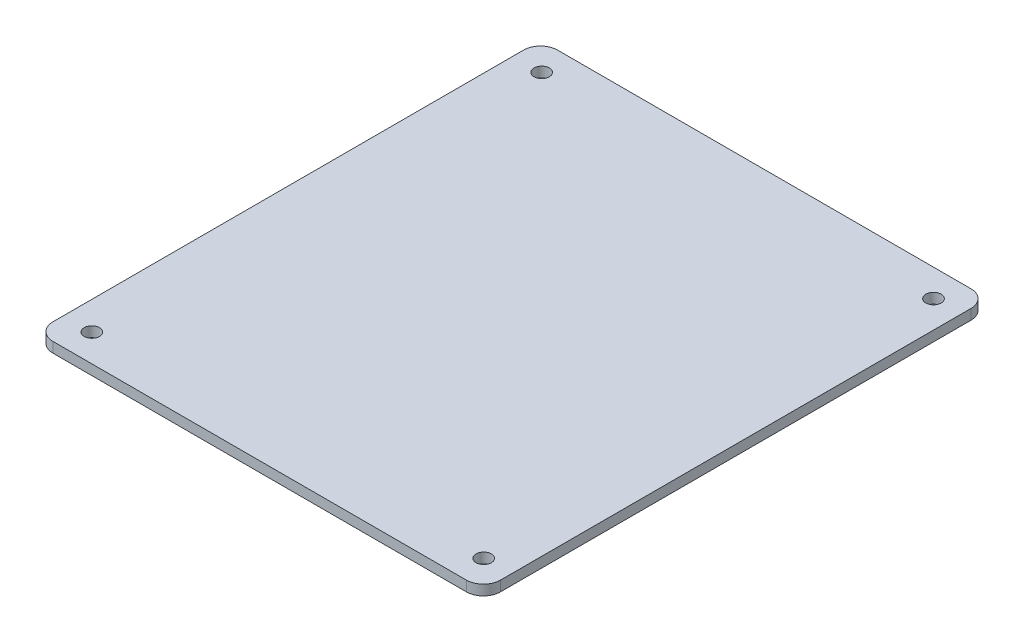
ISO-10303-21;
HEADER;
FILE_DESCRIPTION(('STEP AP214'),'2;1');
FILE_NAME('part.step','',(''),(''),'','','');
FILE_SCHEMA(('AUTOMOTIVE_DESIGN { 1 0 10303 214 1 1 1 1 }'));
ENDSEC;
DATA;
#1=APPLICATION_CONTEXT('core data for automotive mechanical design processes');
#2=APPLICATION_PROTOCOL_DEFINITION('international standard','automotive_design',2000,#1);
#3=PRODUCT_CONTEXT('',#1,'mechanical');
#4=PRODUCT('Part','Part','',(#3));
#5=PRODUCT_RELATED_PRODUCT_CATEGORY('part','',(#4));
#6=PRODUCT_DEFINITION_FORMATION('','',#4);
#7=PRODUCT_DEFINITION_CONTEXT('part definition',#1,'design');
#8=PRODUCT_DEFINITION('design','',#6,#7);
#9=PRODUCT_DEFINITION_SHAPE('','',#8);
#10=(LENGTH_UNIT() NAMED_UNIT(*) SI_UNIT(.MILLI.,.METRE.));
#11=(NAMED_UNIT(*) PLANE_ANGLE_UNIT() SI_UNIT($,.RADIAN.));
#12=(NAMED_UNIT(*) SI_UNIT($,.STERADIAN.) SOLID_ANGLE_UNIT());
#13=UNCERTAINTY_MEASURE_WITH_UNIT(LENGTH_MEASURE(1.E-05),#10,'distance_accuracy_value','');
#14=(GEOMETRIC_REPRESENTATION_CONTEXT(3) GLOBAL_UNCERTAINTY_ASSIGNED_CONTEXT((#13)) GLOBAL_UNIT_ASSIGNED_CONTEXT((#10,
#11,#12)) REPRESENTATION_CONTEXT('',''));
#15=CARTESIAN_POINT('',(0.,0.,0.));
#16=DIRECTION('',(0.,0.,1.));
#17=DIRECTION('',(1.,0.,0.));
#18=AXIS2_PLACEMENT_3D('',#15,#16,#17);
#19=CARTESIAN_POINT('',(-65.2520685764869,3.,73.8375342882427));
#20=DIRECTION('',(0.,0.,-1.));
#21=DIRECTION('',(-1.,0.,0.));
#22=AXIS2_PLACEMENT_3D('',#19,#20,#21);
#23=PLANE('',#22);
#24=DIRECTION('',(1.,0.,0.));
#25=VECTOR('',#24,1.);
#26=CARTESIAN_POINT('',(-65.2520685764869,3.,73.8375342882427));
#27=LINE('',#26,#25);
#28=CARTESIAN_POINT('',(-60.2520685764869,3.,73.8375342882428));
#29=VERTEX_POINT('',#28);
#30=CARTESIAN_POINT('',(61.065931423513,3.,73.8375342882436));
#31=VERTEX_POINT('',#30);
#32=EDGE_CURVE('E127',#29,#31,#27,.T.);
#33=ORIENTED_EDGE('',*,*,#32,.F.);
#34=DIRECTION('',(0.,-1.,0.));
#35=VECTOR('',#34,1.);
#36=CARTESIAN_POINT('',(-60.2520685764869,3.,73.8375342882428));
#37=LINE('',#36,#35);
#38=CARTESIAN_POINT('',(-60.2520685764869,0.,73.8375342882428));
#39=VERTEX_POINT('',#38);
#40=EDGE_CURVE('E11',#29,#39,#37,.T.);
#41=ORIENTED_EDGE('',*,*,#40,.T.);
#42=DIRECTION('',(1.,0.,0.));
#43=VECTOR('',#42,1.);
#44=CARTESIAN_POINT('',(-65.2520685764869,0.,73.8375342882427));
#45=LINE('',#44,#43);
#46=CARTESIAN_POINT('',(61.065931423513,0.,73.8375342882436));
#47=VERTEX_POINT('',#46);
#48=EDGE_CURVE('E158',#39,#47,#45,.T.);
#49=ORIENTED_EDGE('',*,*,#48,.T.);
#50=DIRECTION('',(0.,-1.,0.));
#51=VECTOR('',#50,1.);
#52=CARTESIAN_POINT('',(61.065931423513,3.,73.8375342882436));
#53=LINE('',#52,#51);
#54=EDGE_CURVE('E41',#47,#31,#53,.F.);
#55=ORIENTED_EDGE('',*,*,#54,.T.);
#56=EDGE_LOOP('',(#33,#41,#49,#55));
#57=FACE_BOUND('',#56,.T.);
#58=ADVANCED_FACE('F33',(#57),#23,.F.);
#59=CARTESIAN_POINT('',(66.065931423513,3.,73.8375342882436));
#60=DIRECTION('',(-1.,0.,0.));
#61=DIRECTION('',(0.,0.,1.));
#62=AXIS2_PLACEMENT_3D('',#59,#60,#61);
#63=PLANE('',#62);
#64=DIRECTION('',(0.,0.,-1.));
#65=VECTOR('',#64,1.);
#66=CARTESIAN_POINT('',(66.065931423513,0.,73.8375342882436));
#67=LINE('',#66,#65);
#68=CARTESIAN_POINT('',(66.0659314235131,0.,68.8375342882436));
#69=VERTEX_POINT('',#68);
#70=CARTESIAN_POINT('',(66.065931423514,0.,-69.2444657117563));
#71=VERTEX_POINT('',#70);
#72=EDGE_CURVE('E132',#69,#71,#67,.T.);
#73=ORIENTED_EDGE('',*,*,#72,.T.);
#74=DIRECTION('',(0.,-1.,0.));
#75=VECTOR('',#74,1.);
#76=CARTESIAN_POINT('',(66.065931423514,3.,-69.2444657117563));
#77=LINE('',#76,#75);
#78=CARTESIAN_POINT('',(66.065931423514,3.,-69.2444657117563));
#79=VERTEX_POINT('',#78);
#80=EDGE_CURVE('E48',#71,#79,#77,.F.);
#81=ORIENTED_EDGE('',*,*,#80,.T.);
#82=DIRECTION('',(0.,0.,-1.));
#83=VECTOR('',#82,1.);
#84=CARTESIAN_POINT('',(66.065931423513,3.,73.8375342882436));
#85=LINE('',#84,#83);
#86=CARTESIAN_POINT('',(66.0659314235131,3.,68.8375342882436));
#87=VERTEX_POINT('',#86);
#88=EDGE_CURVE('E130',#87,#79,#85,.T.);
#89=ORIENTED_EDGE('',*,*,#88,.F.);
#90=DIRECTION('',(0.,-1.,0.));
#91=VECTOR('',#90,1.);
#92=CARTESIAN_POINT('',(66.0659314235131,3.,68.8375342882436));
#93=LINE('',#92,#91);
#94=EDGE_CURVE('E150',#87,#69,#93,.T.);
#95=ORIENTED_EDGE('',*,*,#94,.T.);
#96=EDGE_LOOP('',(#73,#81,#89,#95));
#97=FACE_BOUND('',#96,.T.);
#98=ADVANCED_FACE('F165',(#97),#63,.F.);
#99=CARTESIAN_POINT('',(66.0659314235141,3.,-74.2444657117563));
#100=DIRECTION('',(0.,0.,1.));
#101=DIRECTION('',(1.,0.,0.));
#102=AXIS2_PLACEMENT_3D('',#99,#100,#101);
#103=PLANE('',#102);
#104=DIRECTION('',(-1.,0.,0.));
#105=VECTOR('',#104,1.);
#106=CARTESIAN_POINT('',(66.0659314235141,0.,-74.2444657117563));
#107=LINE('',#106,#105);
#108=CARTESIAN_POINT('',(61.0659314235141,0.,-74.2444657117564));
#109=VERTEX_POINT('',#108);
#110=CARTESIAN_POINT('',(-60.2520685764859,0.,-74.2444657117572));
#111=VERTEX_POINT('',#110);
#112=EDGE_CURVE('E128',#109,#111,#107,.T.);
#113=ORIENTED_EDGE('',*,*,#112,.T.);
#114=DIRECTION('',(0.,-1.,0.));
#115=VECTOR('',#114,1.);
#116=CARTESIAN_POINT('',(-60.2520685764859,3.,-74.2444657117572));
#117=LINE('',#116,#115);
#118=CARTESIAN_POINT('',(-60.2520685764859,3.,-74.2444657117572));
#119=VERTEX_POINT('',#118);
#120=EDGE_CURVE('E105',#111,#119,#117,.F.);
#121=ORIENTED_EDGE('',*,*,#120,.T.);
#122=DIRECTION('',(-1.,0.,0.));
#123=VECTOR('',#122,1.);
#124=CARTESIAN_POINT('',(66.0659314235141,3.,-74.2444657117563));
#125=LINE('',#124,#123);
#126=CARTESIAN_POINT('',(61.0659314235141,3.,-74.2444657117564));
#127=VERTEX_POINT('',#126);
#128=EDGE_CURVE('E170',#127,#119,#125,.T.);
#129=ORIENTED_EDGE('',*,*,#128,.F.);
#130=DIRECTION('',(0.,-1.,0.));
#131=VECTOR('',#130,1.);
#132=CARTESIAN_POINT('',(61.0659314235141,3.,-74.2444657117564));
#133=LINE('',#132,#131);
#134=EDGE_CURVE('E110',#127,#109,#133,.T.);
#135=ORIENTED_EDGE('',*,*,#134,.T.);
#136=EDGE_LOOP('',(#113,#121,#129,#135));
#137=FACE_BOUND('',#136,.T.);
#138=ADVANCED_FACE('F230',(#137),#103,.F.);
#139=CARTESIAN_POINT('',(-65.2520685764859,3.,-74.2444657117573));
#140=DIRECTION('',(1.,0.,0.));
#141=DIRECTION('',(0.,0.,-1.));
#142=AXIS2_PLACEMENT_3D('',#139,#140,#141);
#143=PLANE('',#142);
#144=DIRECTION('',(0.,0.,1.));
#145=VECTOR('',#144,1.);
#146=CARTESIAN_POINT('',(-65.2520685764859,3.,-74.2444657117573));
#147=LINE('',#146,#145);
#148=CARTESIAN_POINT('',(-65.2520685764859,3.,-69.2444657117572));
#149=VERTEX_POINT('',#148);
#150=CARTESIAN_POINT('',(-65.2520685764869,3.,68.8375342882427));
#151=VERTEX_POINT('',#150);
#152=EDGE_CURVE('E120',#149,#151,#147,.T.);
#153=ORIENTED_EDGE('',*,*,#152,.F.);
#154=DIRECTION('',(0.,-1.,0.));
#155=VECTOR('',#154,1.);
#156=CARTESIAN_POINT('',(-65.2520685764859,3.,-69.2444657117572));
#157=LINE('',#156,#155);
#158=CARTESIAN_POINT('',(-65.2520685764859,0.,-69.2444657117572));
#159=VERTEX_POINT('',#158);
#160=EDGE_CURVE('E104',#149,#159,#157,.T.);
#161=ORIENTED_EDGE('',*,*,#160,.T.);
#162=DIRECTION('',(0.,0.,1.));
#163=VECTOR('',#162,1.);
#164=CARTESIAN_POINT('',(-65.2520685764859,0.,-74.2444657117573));
#165=LINE('',#164,#163);
#166=CARTESIAN_POINT('',(-65.2520685764869,0.,68.8375342882427));
#167=VERTEX_POINT('',#166);
#168=EDGE_CURVE('E117',#159,#167,#165,.T.);
#169=ORIENTED_EDGE('',*,*,#168,.T.);
#170=DIRECTION('',(0.,-1.,0.));
#171=VECTOR('',#170,1.);
#172=CARTESIAN_POINT('',(-65.2520685764869,3.,68.8375342882427));
#173=LINE('',#172,#171);
#174=EDGE_CURVE('E122',#167,#151,#173,.F.);
#175=ORIENTED_EDGE('',*,*,#174,.T.);
#176=EDGE_LOOP('',(#153,#161,#169,#175));
#177=FACE_BOUND('',#176,.T.);
#178=ADVANCED_FACE('F116',(#177),#143,.F.);
#179=CARTESIAN_POINT('',(0.,3.,0.));
#180=DIRECTION('',(0.,1.,0.));
#181=DIRECTION('',(0.,0.,1.));
#182=AXIS2_PLACEMENT_3D('',#179,#180,#181);
#183=PLANE('',#182);
#184=CARTESIAN_POINT('',(58.0659314235131,3.,65.7555342882436));
#185=DIRECTION('',(0.,1.,0.));
#186=DIRECTION('',(0.,0.,1.));
#187=AXIS2_PLACEMENT_3D('',#184,#185,#186);
#188=CIRCLE('',#187,2.25000000000035);
#189=CARTESIAN_POINT('',(58.0659314235131,3.,68.005534288244));
#190=VERTEX_POINT('',#189);
#191=EDGE_CURVE('E179',#190,#190,#188,.T.);
#192=ORIENTED_EDGE('',*,*,#191,.F.);
#193=EDGE_LOOP('',(#192));
#194=FACE_BOUND('',#193,.T.);
#195=CARTESIAN_POINT('',(58.0659314235135,3.,-66.2444657117564));
#196=DIRECTION('',(0.,1.,0.));
#197=DIRECTION('',(0.,0.,1.));
#198=AXIS2_PLACEMENT_3D('',#195,#196,#197);
#199=CIRCLE('',#198,2.25);
#200=CARTESIAN_POINT('',(58.0659314235135,3.,-63.9944657117564));
#201=VERTEX_POINT('',#200);
#202=EDGE_CURVE('E185',#201,#201,#199,.T.);
#203=ORIENTED_EDGE('',*,*,#202,.F.);
#204=EDGE_LOOP('',(#203));
#205=FACE_BOUND('',#204,.T.);
#206=CARTESIAN_POINT('',(-56.9340685764865,3.,-66.2444657117572));
#207=DIRECTION('',(0.,1.,0.));
#208=DIRECTION('',(0.,0.,1.));
#209=AXIS2_PLACEMENT_3D('',#206,#207,#208);
#210=CIRCLE('',#209,2.25);
#211=CARTESIAN_POINT('',(-56.9340685764865,3.,-63.9944657117572));
#212=VERTEX_POINT('',#211);
#213=EDGE_CURVE('E191',#212,#212,#210,.T.);
#214=ORIENTED_EDGE('',*,*,#213,.F.);
#215=EDGE_LOOP('',(#214));
#216=FACE_BOUND('',#215,.T.);
#217=CARTESIAN_POINT('',(-56.9340685764874,3.,65.7555342882428));
#218=DIRECTION('',(0.,1.,0.));
#219=DIRECTION('',(0.,0.,1.));
#220=AXIS2_PLACEMENT_3D('',#217,#218,#219);
#221=CIRCLE('',#220,2.25);
#222=CARTESIAN_POINT('',(-56.9340685764874,3.,68.0055342882428));
#223=VERTEX_POINT('',#222);
#224=EDGE_CURVE('E173',#223,#223,#221,.T.);
#225=ORIENTED_EDGE('',*,*,#224,.F.);
#226=EDGE_LOOP('',(#225));
#227=FACE_BOUND('',#226,.T.);
#228=ORIENTED_EDGE('',*,*,#128,.T.);
#229=CARTESIAN_POINT('',(-60.2520685764859,3.,-69.2444657117572));
#230=DIRECTION('',(0.,1.,0.));
#231=DIRECTION('',(0.,0.,1.));
#232=AXIS2_PLACEMENT_3D('',#229,#230,#231);
#233=CIRCLE('',#232,5.);
#234=EDGE_CURVE('E148',#119,#149,#233,.T.);
#235=ORIENTED_EDGE('',*,*,#234,.T.);
#236=ORIENTED_EDGE('',*,*,#152,.T.);
#237=CARTESIAN_POINT('',(-60.2520685764869,3.,68.8375342882428));
#238=DIRECTION('',(0.,1.,0.));
#239=DIRECTION('',(0.,0.,1.));
#240=AXIS2_PLACEMENT_3D('',#237,#238,#239);
#241=CIRCLE('',#240,5.);
#242=EDGE_CURVE('E144',#151,#29,#241,.T.);
#243=ORIENTED_EDGE('',*,*,#242,.T.);
#244=ORIENTED_EDGE('',*,*,#32,.T.);
#245=CARTESIAN_POINT('',(61.0659314235131,3.,68.8375342882436));
#246=DIRECTION('',(0.,1.,0.));
#247=DIRECTION('',(0.,0.,1.));
#248=AXIS2_PLACEMENT_3D('',#245,#246,#247);
#249=CIRCLE('',#248,5.);
#250=EDGE_CURVE('E55',#31,#87,#249,.T.);
#251=ORIENTED_EDGE('',*,*,#250,.T.);
#252=ORIENTED_EDGE('',*,*,#88,.T.);
#253=CARTESIAN_POINT('',(61.065931423514,3.,-69.2444657117564));
#254=DIRECTION('',(0.,1.,0.));
#255=DIRECTION('',(0.,0.,1.));
#256=AXIS2_PLACEMENT_3D('',#253,#254,#255);
#257=CIRCLE('',#256,5.);
#258=EDGE_CURVE('E146',#79,#127,#257,.T.);
#259=ORIENTED_EDGE('',*,*,#258,.T.);
#260=EDGE_LOOP('',(#228,#235,#236,#243,#244,#251,#252,#259));
#261=FACE_BOUND('',#260,.T.);
#262=ADVANCED_FACE('F161',(#194,#205,#216,#227,#261),#183,.T.);
#263=CARTESIAN_POINT('',(0.,0.,0.));
#264=DIRECTION('',(0.,1.,0.));
#265=DIRECTION('',(0.,0.,1.));
#266=AXIS2_PLACEMENT_3D('',#263,#264,#265);
#267=PLANE('',#266);
#268=CARTESIAN_POINT('',(58.0659314235131,0.,65.7555342882436));
#269=DIRECTION('',(0.,1.,0.));
#270=DIRECTION('',(0.,0.,1.));
#271=AXIS2_PLACEMENT_3D('',#268,#269,#270);
#272=CIRCLE('',#271,2.25000000000035);
#273=CARTESIAN_POINT('',(58.0659314235131,0.,68.005534288244));
#274=VERTEX_POINT('',#273);
#275=EDGE_CURVE('E182',#274,#274,#272,.T.);
#276=ORIENTED_EDGE('',*,*,#275,.T.);
#277=EDGE_LOOP('',(#276));
#278=FACE_BOUND('',#277,.T.);
#279=CARTESIAN_POINT('',(58.0659314235135,0.,-66.2444657117564));
#280=DIRECTION('',(0.,1.,0.));
#281=DIRECTION('',(0.,0.,1.));
#282=AXIS2_PLACEMENT_3D('',#279,#280,#281);
#283=CIRCLE('',#282,2.25);
#284=CARTESIAN_POINT('',(58.0659314235135,0.,-63.9944657117564));
#285=VERTEX_POINT('',#284);
#286=EDGE_CURVE('E188',#285,#285,#283,.T.);
#287=ORIENTED_EDGE('',*,*,#286,.T.);
#288=EDGE_LOOP('',(#287));
#289=FACE_BOUND('',#288,.T.);
#290=CARTESIAN_POINT('',(-56.9340685764865,0.,-66.2444657117572));
#291=DIRECTION('',(0.,1.,0.));
#292=DIRECTION('',(0.,0.,1.));
#293=AXIS2_PLACEMENT_3D('',#290,#291,#292);
#294=CIRCLE('',#293,2.25);
#295=CARTESIAN_POINT('',(-56.9340685764865,0.,-63.9944657117572));
#296=VERTEX_POINT('',#295);
#297=EDGE_CURVE('E176',#296,#296,#294,.T.);
#298=ORIENTED_EDGE('',*,*,#297,.T.);
#299=EDGE_LOOP('',(#298));
#300=FACE_BOUND('',#299,.T.);
#301=CARTESIAN_POINT('',(-56.9340685764874,0.,65.7555342882428));
#302=DIRECTION('',(0.,1.,0.));
#303=DIRECTION('',(0.,0.,1.));
#304=AXIS2_PLACEMENT_3D('',#301,#302,#303);
#305=CIRCLE('',#304,2.25);
#306=CARTESIAN_POINT('',(-56.9340685764874,0.,68.0055342882428));
#307=VERTEX_POINT('',#306);
#308=EDGE_CURVE('E166',#307,#307,#305,.T.);
#309=ORIENTED_EDGE('',*,*,#308,.T.);
#310=EDGE_LOOP('',(#309));
#311=FACE_BOUND('',#310,.T.);
#312=ORIENTED_EDGE('',*,*,#168,.F.);
#313=CARTESIAN_POINT('',(-60.2520685764859,0.,-69.2444657117572));
#314=DIRECTION('',(0.,1.,0.));
#315=DIRECTION('',(0.,0.,1.));
#316=AXIS2_PLACEMENT_3D('',#313,#314,#315);
#317=CIRCLE('',#316,5.);
#318=EDGE_CURVE('E100',#159,#111,#317,.F.);
#319=ORIENTED_EDGE('',*,*,#318,.T.);
#320=ORIENTED_EDGE('',*,*,#112,.F.);
#321=CARTESIAN_POINT('',(61.065931423514,0.,-69.2444657117564));
#322=DIRECTION('',(0.,1.,0.));
#323=DIRECTION('',(0.,0.,1.));
#324=AXIS2_PLACEMENT_3D('',#321,#322,#323);
#325=CIRCLE('',#324,5.);
#326=EDGE_CURVE('E111',#109,#71,#325,.F.);
#327=ORIENTED_EDGE('',*,*,#326,.T.);
#328=ORIENTED_EDGE('',*,*,#72,.F.);
#329=CARTESIAN_POINT('',(61.0659314235131,0.,68.8375342882436));
#330=DIRECTION('',(0.,1.,0.));
#331=DIRECTION('',(0.,0.,1.));
#332=AXIS2_PLACEMENT_3D('',#329,#330,#331);
#333=CIRCLE('',#332,5.);
#334=EDGE_CURVE('E121',#69,#47,#333,.F.);
#335=ORIENTED_EDGE('',*,*,#334,.T.);
#336=ORIENTED_EDGE('',*,*,#48,.F.);
#337=CARTESIAN_POINT('',(-60.2520685764869,0.,68.8375342882428));
#338=DIRECTION('',(0.,1.,0.));
#339=DIRECTION('',(0.,0.,1.));
#340=AXIS2_PLACEMENT_3D('',#337,#338,#339);
#341=CIRCLE('',#340,5.);
#342=EDGE_CURVE('E126',#39,#167,#341,.F.);
#343=ORIENTED_EDGE('',*,*,#342,.T.);
#344=EDGE_LOOP('',(#312,#319,#320,#327,#328,#335,#336,#343));
#345=FACE_BOUND('',#344,.T.);
#346=ADVANCED_FACE('F124',(#278,#289,#300,#311,#345),#267,.F.);
#347=CARTESIAN_POINT('',(-56.9340685764874,0.,65.7555342882428));
#348=DIRECTION('',(0.,1.,0.));
#349=DIRECTION('',(0.,0.,1.));
#350=AXIS2_PLACEMENT_3D('',#347,#348,#349);
#351=CYLINDRICAL_SURFACE('',#350,2.25);
#352=ORIENTED_EDGE('',*,*,#308,.F.);
#353=EDGE_LOOP('',(#352));
#354=FACE_BOUND('',#353,.T.);
#355=ORIENTED_EDGE('',*,*,#224,.T.);
#356=EDGE_LOOP('',(#355));
#357=FACE_BOUND('',#356,.T.);
#358=ADVANCED_FACE('F203',(#354,#357),#351,.F.);
#359=CARTESIAN_POINT('',(-56.9340685764865,0.,-66.2444657117572));
#360=DIRECTION('',(0.,1.,0.));
#361=DIRECTION('',(0.,0.,1.));
#362=AXIS2_PLACEMENT_3D('',#359,#360,#361);
#363=CYLINDRICAL_SURFACE('',#362,2.25);
#364=ORIENTED_EDGE('',*,*,#297,.F.);
#365=EDGE_LOOP('',(#364));
#366=FACE_BOUND('',#365,.T.);
#367=ORIENTED_EDGE('',*,*,#213,.T.);
#368=EDGE_LOOP('',(#367));
#369=FACE_BOUND('',#368,.T.);
#370=ADVANCED_FACE('F199',(#366,#369),#363,.F.);
#371=CARTESIAN_POINT('',(58.0659314235135,0.,-66.2444657117564));
#372=DIRECTION('',(0.,1.,0.));
#373=DIRECTION('',(0.,0.,1.));
#374=AXIS2_PLACEMENT_3D('',#371,#372,#373);
#375=CYLINDRICAL_SURFACE('',#374,2.25);
#376=ORIENTED_EDGE('',*,*,#286,.F.);
#377=EDGE_LOOP('',(#376));
#378=FACE_BOUND('',#377,.T.);
#379=ORIENTED_EDGE('',*,*,#202,.T.);
#380=EDGE_LOOP('',(#379));
#381=FACE_BOUND('',#380,.T.);
#382=ADVANCED_FACE('F202',(#378,#381),#375,.F.);
#383=CARTESIAN_POINT('',(58.0659314235131,0.,65.7555342882436));
#384=DIRECTION('',(0.,1.,0.));
#385=DIRECTION('',(0.,0.,1.));
#386=AXIS2_PLACEMENT_3D('',#383,#384,#385);
#387=CYLINDRICAL_SURFACE('',#386,2.25000000000035);
#388=ORIENTED_EDGE('',*,*,#275,.F.);
#389=EDGE_LOOP('',(#388));
#390=FACE_BOUND('',#389,.T.);
#391=ORIENTED_EDGE('',*,*,#191,.T.);
#392=EDGE_LOOP('',(#391));
#393=FACE_BOUND('',#392,.T.);
#394=ADVANCED_FACE('F237',(#390,#393),#387,.F.);
#395=CARTESIAN_POINT('',(-60.2520685764859,3.,-69.2444657117572));
#396=DIRECTION('',(0.,-1.,0.));
#397=DIRECTION('',(0.,0.,-1.));
#398=AXIS2_PLACEMENT_3D('',#395,#396,#397);
#399=CYLINDRICAL_SURFACE('',#398,5.);
#400=ORIENTED_EDGE('',*,*,#234,.F.);
#401=ORIENTED_EDGE('',*,*,#120,.F.);
#402=ORIENTED_EDGE('',*,*,#318,.F.);
#403=ORIENTED_EDGE('',*,*,#160,.F.);
#404=EDGE_LOOP('',(#400,#401,#402,#403));
#405=FACE_BOUND('',#404,.T.);
#406=ADVANCED_FACE('F103',(#405),#399,.T.);
#407=CARTESIAN_POINT('',(61.065931423514,3.,-69.2444657117564));
#408=DIRECTION('',(0.,-1.,0.));
#409=DIRECTION('',(0.,0.,-1.));
#410=AXIS2_PLACEMENT_3D('',#407,#408,#409);
#411=CYLINDRICAL_SURFACE('',#410,5.);
#412=ORIENTED_EDGE('',*,*,#258,.F.);
#413=ORIENTED_EDGE('',*,*,#80,.F.);
#414=ORIENTED_EDGE('',*,*,#326,.F.);
#415=ORIENTED_EDGE('',*,*,#134,.F.);
#416=EDGE_LOOP('',(#412,#413,#414,#415));
#417=FACE_BOUND('',#416,.T.);
#418=ADVANCED_FACE('F236',(#417),#411,.T.);
#419=CARTESIAN_POINT('',(-60.2520685764869,3.,68.8375342882428));
#420=DIRECTION('',(0.,-1.,0.));
#421=DIRECTION('',(0.,0.,-1.));
#422=AXIS2_PLACEMENT_3D('',#419,#420,#421);
#423=CYLINDRICAL_SURFACE('',#422,5.);
#424=ORIENTED_EDGE('',*,*,#242,.F.);
#425=ORIENTED_EDGE('',*,*,#174,.F.);
#426=ORIENTED_EDGE('',*,*,#342,.F.);
#427=ORIENTED_EDGE('',*,*,#40,.F.);
#428=EDGE_LOOP('',(#424,#425,#426,#427));
#429=FACE_BOUND('',#428,.T.);
#430=ADVANCED_FACE('F239',(#429),#423,.T.);
#431=CARTESIAN_POINT('',(61.0659314235131,3.,68.8375342882436));
#432=DIRECTION('',(0.,-1.,0.));
#433=DIRECTION('',(0.,0.,-1.));
#434=AXIS2_PLACEMENT_3D('',#431,#432,#433);
#435=CYLINDRICAL_SURFACE('',#434,5.);
#436=ORIENTED_EDGE('',*,*,#250,.F.);
#437=ORIENTED_EDGE('',*,*,#54,.F.);
#438=ORIENTED_EDGE('',*,*,#334,.F.);
#439=ORIENTED_EDGE('',*,*,#94,.F.);
#440=EDGE_LOOP('',(#436,#437,#438,#439));
#441=FACE_BOUND('',#440,.T.);
#442=ADVANCED_FACE('F35',(#441),#435,.T.);
#443=CLOSED_SHELL('',(#58,#98,#138,#178,#262,#346,#358,#370,#382,#394,#406,#418,#430,#442));
#444=MANIFOLD_SOLID_BREP('B2',#443);
#445=ADVANCED_BREP_SHAPE_REPRESENTATION('',(#18,#444),#14);
#446=SHAPE_DEFINITION_REPRESENTATION(#9,#445);
ENDSEC;
END-ISO-10303-21;
